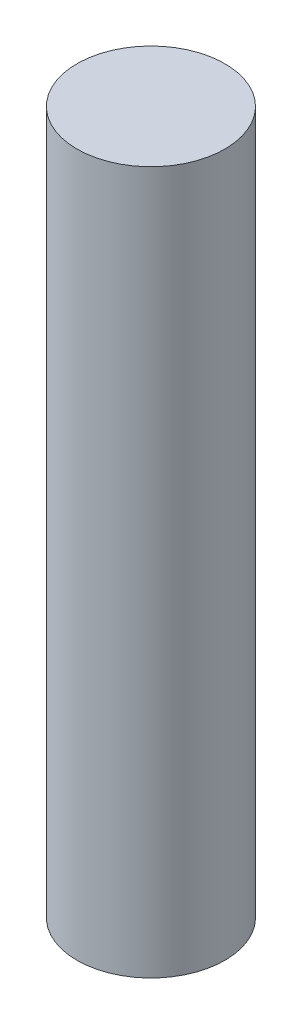
ISO-10303-21;
HEADER;
FILE_DESCRIPTION(('STEP AP214'),'2;1');
FILE_NAME('part.step','',(''),(''),'','','');
FILE_SCHEMA(('AUTOMOTIVE_DESIGN { 1 0 10303 214 1 1 1 1 }'));
ENDSEC;
DATA;
#1=APPLICATION_CONTEXT('core data for automotive mechanical design processes');
#2=APPLICATION_PROTOCOL_DEFINITION('international standard','automotive_design',2000,#1);
#3=PRODUCT_CONTEXT('',#1,'mechanical');
#4=PRODUCT('Part','Part','',(#3));
#5=PRODUCT_RELATED_PRODUCT_CATEGORY('part','',(#4));
#6=PRODUCT_DEFINITION_FORMATION('','',#4);
#7=PRODUCT_DEFINITION_CONTEXT('part definition',#1,'design');
#8=PRODUCT_DEFINITION('design','',#6,#7);
#9=PRODUCT_DEFINITION_SHAPE('','',#8);
#10=(LENGTH_UNIT() NAMED_UNIT(*) SI_UNIT(.MILLI.,.METRE.));
#11=(NAMED_UNIT(*) PLANE_ANGLE_UNIT() SI_UNIT($,.RADIAN.));
#12=(NAMED_UNIT(*) SI_UNIT($,.STERADIAN.) SOLID_ANGLE_UNIT());
#13=UNCERTAINTY_MEASURE_WITH_UNIT(LENGTH_MEASURE(1.E-05),#10,'distance_accuracy_value','');
#14=(GEOMETRIC_REPRESENTATION_CONTEXT(3) GLOBAL_UNCERTAINTY_ASSIGNED_CONTEXT((#13)) GLOBAL_UNIT_ASSIGNED_CONTEXT((#10,
#11,#12)) REPRESENTATION_CONTEXT('',''));
#15=CARTESIAN_POINT('',(0.,0.,0.));
#16=DIRECTION('',(0.,0.,1.));
#17=DIRECTION('',(1.,0.,0.));
#18=AXIS2_PLACEMENT_3D('',#15,#16,#17);
#19=CARTESIAN_POINT('',(0.,9.5,0.));
#20=DIRECTION('',(0.,-1.,0.));
#21=DIRECTION('',(0.,0.,-1.));
#22=AXIS2_PLACEMENT_3D('',#19,#20,#21);
#23=CYLINDRICAL_SURFACE('',#22,1.);
#24=CARTESIAN_POINT('',(0.,9.5,0.));
#25=DIRECTION('',(0.,1.,0.));
#26=DIRECTION('',(0.,0.,1.));
#27=AXIS2_PLACEMENT_3D('',#24,#25,#26);
#28=CIRCLE('',#27,1.);
#29=CARTESIAN_POINT('',(0.,9.5,1.));
#30=VERTEX_POINT('',#29);
#31=EDGE_CURVE('E10',#30,#30,#28,.T.);
#32=ORIENTED_EDGE('',*,*,#31,.F.);
#33=EDGE_LOOP('',(#32));
#34=FACE_BOUND('',#33,.T.);
#35=CARTESIAN_POINT('',(0.,0.,0.));
#36=DIRECTION('',(0.,1.,0.));
#37=DIRECTION('',(0.,0.,1.));
#38=AXIS2_PLACEMENT_3D('',#35,#36,#37);
#39=CIRCLE('',#38,1.);
#40=CARTESIAN_POINT('',(0.,0.,1.));
#41=VERTEX_POINT('',#40);
#42=EDGE_CURVE('E33',#41,#41,#39,.T.);
#43=ORIENTED_EDGE('',*,*,#42,.T.);
#44=EDGE_LOOP('',(#43));
#45=FACE_BOUND('',#44,.T.);
#46=ADVANCED_FACE('F30',(#34,#45),#23,.T.);
#47=CARTESIAN_POINT('',(0.,9.5,0.));
#48=DIRECTION('',(0.,1.,0.));
#49=DIRECTION('',(0.,0.,1.));
#50=AXIS2_PLACEMENT_3D('',#47,#48,#49);
#51=PLANE('',#50);
#52=ORIENTED_EDGE('',*,*,#31,.T.);
#53=EDGE_LOOP('',(#52));
#54=FACE_BOUND('',#53,.T.);
#55=ADVANCED_FACE('F45',(#54),#51,.T.);
#56=CARTESIAN_POINT('',(0.,0.,0.));
#57=DIRECTION('',(0.,1.,0.));
#58=DIRECTION('',(0.,0.,1.));
#59=AXIS2_PLACEMENT_3D('',#56,#57,#58);
#60=PLANE('',#59);
#61=ORIENTED_EDGE('',*,*,#42,.F.);
#62=EDGE_LOOP('',(#61));
#63=FACE_BOUND('',#62,.T.);
#64=ADVANCED_FACE('F43',(#63),#60,.F.);
#65=CLOSED_SHELL('',(#46,#55,#64));
#66=MANIFOLD_SOLID_BREP('B2',#65);
#67=ADVANCED_BREP_SHAPE_REPRESENTATION('',(#18,#66),#14);
#68=SHAPE_DEFINITION_REPRESENTATION(#9,#67);
ENDSEC;
END-ISO-10303-21;
